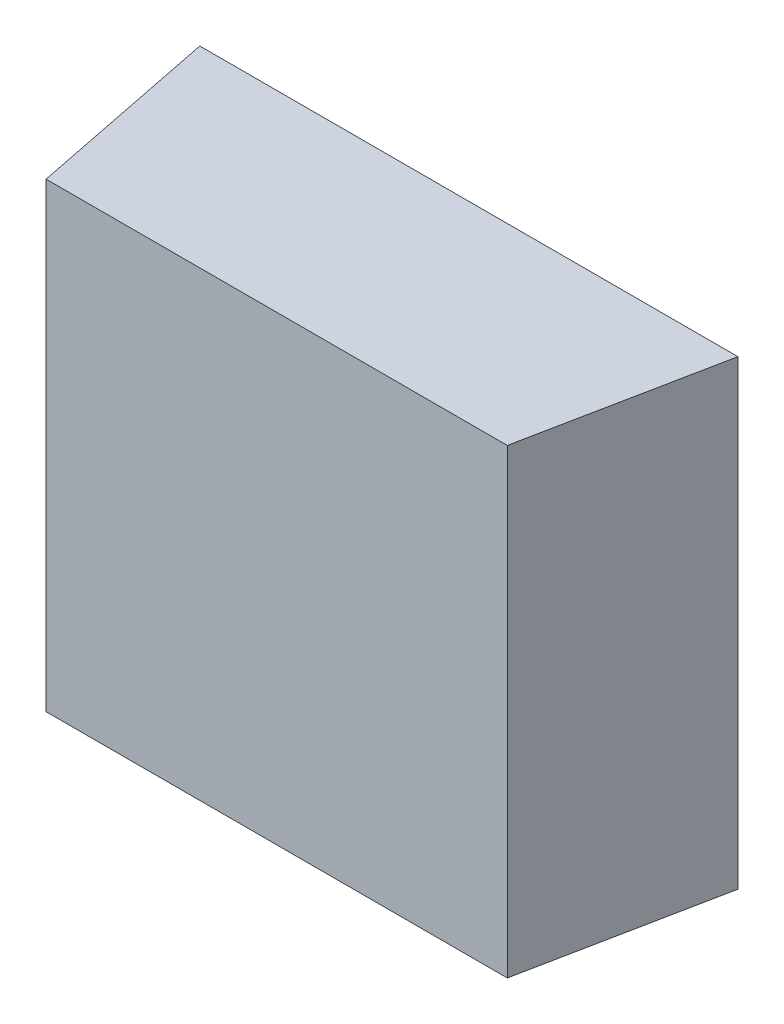
ISO-10303-21;
HEADER;
FILE_DESCRIPTION(('STEP AP214'),'2;1');
FILE_NAME('part.step','',(''),(''),'','','');
FILE_SCHEMA(('AUTOMOTIVE_DESIGN { 1 0 10303 214 1 1 1 1 }'));
ENDSEC;
DATA;
#1=APPLICATION_CONTEXT('core data for automotive mechanical design processes');
#2=APPLICATION_PROTOCOL_DEFINITION('international standard','automotive_design',2000,#1);
#3=PRODUCT_CONTEXT('',#1,'mechanical');
#4=PRODUCT('Part','Part','',(#3));
#5=PRODUCT_RELATED_PRODUCT_CATEGORY('part','',(#4));
#6=PRODUCT_DEFINITION_FORMATION('','',#4);
#7=PRODUCT_DEFINITION_CONTEXT('part definition',#1,'design');
#8=PRODUCT_DEFINITION('design','',#6,#7);
#9=PRODUCT_DEFINITION_SHAPE('','',#8);
#10=(LENGTH_UNIT() NAMED_UNIT(*) SI_UNIT(.MILLI.,.METRE.));
#11=(NAMED_UNIT(*) PLANE_ANGLE_UNIT() SI_UNIT($,.RADIAN.));
#12=(NAMED_UNIT(*) SI_UNIT($,.STERADIAN.) SOLID_ANGLE_UNIT());
#13=UNCERTAINTY_MEASURE_WITH_UNIT(LENGTH_MEASURE(1.E-05),#10,'distance_accuracy_value','');
#14=(GEOMETRIC_REPRESENTATION_CONTEXT(3) GLOBAL_UNCERTAINTY_ASSIGNED_CONTEXT((#13)) GLOBAL_UNIT_ASSIGNED_CONTEXT((#10,
#11,#12)) REPRESENTATION_CONTEXT('',''));
#15=CARTESIAN_POINT('',(0.,0.,0.));
#16=DIRECTION('',(0.,0.,1.));
#17=DIRECTION('',(1.,0.,0.));
#18=AXIS2_PLACEMENT_3D('',#15,#16,#17);
#19=CARTESIAN_POINT('',(-0.499685678621241,-0.927979057558617,0.0911708661417334));
#20=DIRECTION('',(0.,0.,-1.));
#21=DIRECTION('',(-1.,0.,0.));
#22=AXIS2_PLACEMENT_3D('',#19,#20,#21);
#23=PLANE('',#22);
#24=DIRECTION('',(0.,1.,0.));
#25=VECTOR('',#24,1.);
#26=CARTESIAN_POINT('',(-0.497725048699981,-0.927979057558617,0.0911708661417335));
#27=LINE('',#26,#25);
#28=CARTESIAN_POINT('',(-0.497725048699981,-0.929939687479877,0.0911708661417334));
#29=VERTEX_POINT('',#28);
#30=CARTESIAN_POINT('',(-0.497725048699981,-0.969152285905073,0.0911708661417334));
#31=VERTEX_POINT('',#30);
#32=EDGE_CURVE('E20',#29,#31,#27,.F.);
#33=ORIENTED_EDGE('',*,*,#32,.T.);
#34=DIRECTION('',(1.,0.,0.));
#35=VECTOR('',#34,1.);
#36=CARTESIAN_POINT('',(-0.503280166810218,-0.969152285905073,0.0911708661417334));
#37=LINE('',#36,#35);
#38=CARTESIAN_POINT('',(-0.458512450274785,-0.969152285905073,0.0911708661417334));
#39=VERTEX_POINT('',#38);
#40=EDGE_CURVE('E55',#39,#31,#37,.F.);
#41=ORIENTED_EDGE('',*,*,#40,.F.);
#42=DIRECTION('',(0.,1.,0.));
#43=VECTOR('',#42,1.);
#44=CARTESIAN_POINT('',(-0.458512450274784,-0.927979057558617,0.0911708661417335));
#45=LINE('',#44,#43);
#46=CARTESIAN_POINT('',(-0.458512450274785,-0.929939687479877,0.0911708661417335));
#47=VERTEX_POINT('',#46);
#48=EDGE_CURVE('E76',#39,#47,#45,.T.);
#49=ORIENTED_EDGE('',*,*,#48,.T.);
#50=DIRECTION('',(1.,0.,0.));
#51=VECTOR('',#50,1.);
#52=CARTESIAN_POINT('',(-0.503280166810218,-0.929939687479877,0.0911708661417334));
#53=LINE('',#52,#51);
#54=EDGE_CURVE('E58',#47,#29,#53,.F.);
#55=ORIENTED_EDGE('',*,*,#54,.T.);
#56=EDGE_LOOP('',(#33,#41,#49,#55));
#57=FACE_BOUND('',#56,.T.);
#58=ADVANCED_FACE('F17',(#57),#23,.F.);
#59=CARTESIAN_POINT('',(-0.501156151062186,-0.927979057558617,0.0740153543307098));
#60=DIRECTION('',(0.980580675690921,0.,-0.196116135138182));
#61=DIRECTION('',(-0.196116135138182,0.,-0.980580675690921));
#62=AXIS2_PLACEMENT_3D('',#59,#60,#61);
#63=PLANE('',#62);
#64=DIRECTION('',(0.,1.,0.));
#65=VECTOR('',#64,1.);
#66=CARTESIAN_POINT('',(-0.500992765235415,-0.927979057558617,0.0748322834645681));
#67=LINE('',#66,#65);
#68=CARTESIAN_POINT('',(-0.500992765235415,-0.929939687479877,0.0748322834645681));
#69=VERTEX_POINT('',#68);
#70=CARTESIAN_POINT('',(-0.500992765235415,-0.969152285905073,0.0748322834645681));
#71=VERTEX_POINT('',#70);
#72=EDGE_CURVE('E73',#69,#71,#67,.F.);
#73=ORIENTED_EDGE('',*,*,#72,.T.);
#74=DIRECTION('',(-0.196116135138239,0.,-0.980580675690909));
#75=VECTOR('',#74,1.);
#76=CARTESIAN_POINT('',(-0.497725048699981,-0.969152285905073,0.0911708661417334));
#77=LINE('',#76,#75);
#78=EDGE_CURVE('E63',#31,#71,#77,.T.);
#79=ORIENTED_EDGE('',*,*,#78,.F.);
#80=ORIENTED_EDGE('',*,*,#32,.F.);
#81=DIRECTION('',(-0.196116135138239,0.,-0.980580675690909));
#82=VECTOR('',#81,1.);
#83=CARTESIAN_POINT('',(-0.497725048699981,-0.929939687479877,0.0911708661417334));
#84=LINE('',#83,#82);
#85=EDGE_CURVE('E80',#29,#69,#84,.T.);
#86=ORIENTED_EDGE('',*,*,#85,.T.);
#87=EDGE_LOOP('',(#73,#79,#80,#86));
#88=FACE_BOUND('',#87,.T.);
#89=ADVANCED_FACE('F72',(#88),#63,.F.);
#90=CARTESIAN_POINT('',(-0.503280166810218,-0.969152285905073,0.0740153543307098));
#91=DIRECTION('',(0.,-1.,0.));
#92=DIRECTION('',(1.,0.,0.));
#93=AXIS2_PLACEMENT_3D('',#90,#91,#92);
#94=PLANE('',#93);
#95=DIRECTION('',(-0.196116135138182,0.,0.980580675690921));
#96=VECTOR('',#95,1.);
#97=CARTESIAN_POINT('',(-0.458675836101556,-0.969152285905073,0.0919877952755917));
#98=LINE('',#97,#96);
#99=CARTESIAN_POINT('',(-0.455244733739351,-0.969152285905073,0.0748322834645681));
#100=VERTEX_POINT('',#99);
#101=EDGE_CURVE('E69',#100,#39,#98,.T.);
#102=ORIENTED_EDGE('',*,*,#101,.T.);
#103=ORIENTED_EDGE('',*,*,#40,.T.);
#104=ORIENTED_EDGE('',*,*,#78,.T.);
#105=DIRECTION('',(1.,0.,0.));
#106=VECTOR('',#105,1.);
#107=CARTESIAN_POINT('',(-0.452957332164548,-0.969152285905073,0.0748322834645681));
#108=LINE('',#107,#106);
#109=EDGE_CURVE('E83',#71,#100,#108,.T.);
#110=ORIENTED_EDGE('',*,*,#109,.T.);
#111=EDGE_LOOP('',(#102,#103,#104,#110));
#112=FACE_BOUND('',#111,.T.);
#113=ADVANCED_FACE('F66',(#112),#94,.T.);
#114=CARTESIAN_POINT('',(-0.458675836101556,-0.927979057558617,0.0919877952755917));
#115=DIRECTION('',(-0.980580675690921,0.,-0.196116135138182));
#116=DIRECTION('',(-0.196116135138182,0.,0.980580675690921));
#117=AXIS2_PLACEMENT_3D('',#114,#115,#116);
#118=PLANE('',#117);
#119=ORIENTED_EDGE('',*,*,#48,.F.);
#120=ORIENTED_EDGE('',*,*,#101,.F.);
#121=DIRECTION('',(0.,1.,0.));
#122=VECTOR('',#121,1.);
#123=CARTESIAN_POINT('',(-0.455244733739351,-0.927979057558617,0.0748322834645681));
#124=LINE('',#123,#122);
#125=CARTESIAN_POINT('',(-0.455244733739351,-0.929939687479877,0.0748322834645681));
#126=VERTEX_POINT('',#125);
#127=EDGE_CURVE('E26',#100,#126,#124,.T.);
#128=ORIENTED_EDGE('',*,*,#127,.T.);
#129=DIRECTION('',(-0.196116135138239,0.,0.980580675690909));
#130=VECTOR('',#129,1.);
#131=CARTESIAN_POINT('',(-0.455244733739351,-0.929939687479877,0.0748322834645681));
#132=LINE('',#131,#130);
#133=EDGE_CURVE('E34',#126,#47,#132,.T.);
#134=ORIENTED_EDGE('',*,*,#133,.T.);
#135=EDGE_LOOP('',(#119,#120,#128,#134));
#136=FACE_BOUND('',#135,.T.);
#137=ADVANCED_FACE('F88',(#136),#118,.F.);
#138=CARTESIAN_POINT('',(-0.503280166810218,-0.929939687479877,0.0740153543307098));
#139=DIRECTION('',(0.,-1.,0.));
#140=DIRECTION('',(1.,0.,0.));
#141=AXIS2_PLACEMENT_3D('',#138,#139,#140);
#142=PLANE('',#141);
#143=ORIENTED_EDGE('',*,*,#54,.F.);
#144=ORIENTED_EDGE('',*,*,#133,.F.);
#145=DIRECTION('',(1.,0.,0.));
#146=VECTOR('',#145,1.);
#147=CARTESIAN_POINT('',(-0.452957332164548,-0.929939687479877,0.0748322834645681));
#148=LINE('',#147,#146);
#149=EDGE_CURVE('E11',#126,#69,#148,.F.);
#150=ORIENTED_EDGE('',*,*,#149,.T.);
#151=ORIENTED_EDGE('',*,*,#85,.F.);
#152=EDGE_LOOP('',(#143,#144,#150,#151));
#153=FACE_BOUND('',#152,.T.);
#154=ADVANCED_FACE('F91',(#153),#142,.F.);
#155=CARTESIAN_POINT('',(-0.452957332164548,-0.927979057558617,0.0748322834645681));
#156=DIRECTION('',(0.,0.,1.));
#157=DIRECTION('',(1.,0.,0.));
#158=AXIS2_PLACEMENT_3D('',#155,#156,#157);
#159=PLANE('',#158);
#160=ORIENTED_EDGE('',*,*,#127,.F.);
#161=ORIENTED_EDGE('',*,*,#109,.F.);
#162=ORIENTED_EDGE('',*,*,#72,.F.);
#163=ORIENTED_EDGE('',*,*,#149,.F.);
#164=EDGE_LOOP('',(#160,#161,#162,#163));
#165=FACE_BOUND('',#164,.T.);
#166=ADVANCED_FACE('F90',(#165),#159,.F.);
#167=CLOSED_SHELL('',(#58,#89,#113,#137,#154,#166));
#168=MANIFOLD_SOLID_BREP('B1',#167);
#169=ADVANCED_BREP_SHAPE_REPRESENTATION('',(#18,#168),#14);
#170=SHAPE_DEFINITION_REPRESENTATION(#9,#169);
ENDSEC;
END-ISO-10303-21;
